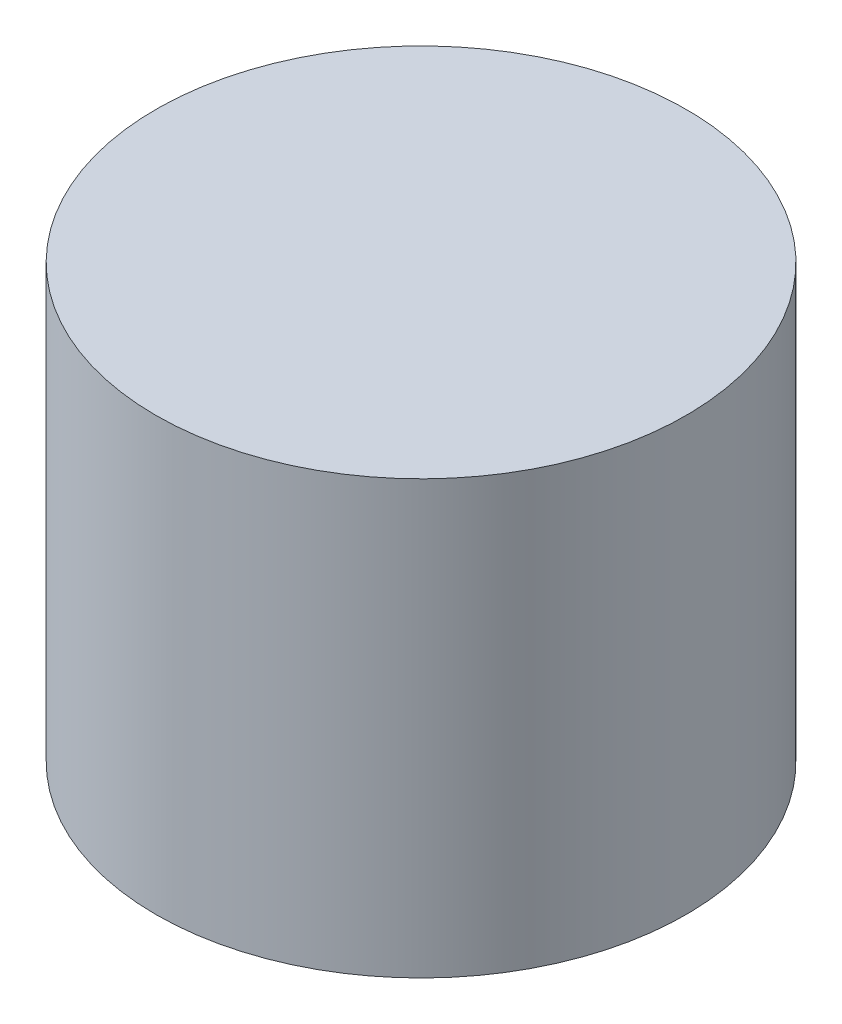
ISO-10303-21;
HEADER;
FILE_DESCRIPTION(('STEP AP214'),'2;1');
FILE_NAME('part.step','',(''),(''),'','','');
FILE_SCHEMA(('AUTOMOTIVE_DESIGN { 1 0 10303 214 1 1 1 1 }'));
ENDSEC;
DATA;
#1=APPLICATION_CONTEXT('core data for automotive mechanical design processes');
#2=APPLICATION_PROTOCOL_DEFINITION('international standard','automotive_design',2000,#1);
#3=PRODUCT_CONTEXT('',#1,'mechanical');
#4=PRODUCT('Part','Part','',(#3));
#5=PRODUCT_RELATED_PRODUCT_CATEGORY('part','',(#4));
#6=PRODUCT_DEFINITION_FORMATION('','',#4);
#7=PRODUCT_DEFINITION_CONTEXT('part definition',#1,'design');
#8=PRODUCT_DEFINITION('design','',#6,#7);
#9=PRODUCT_DEFINITION_SHAPE('','',#8);
#10=(LENGTH_UNIT() NAMED_UNIT(*) SI_UNIT(.MILLI.,.METRE.));
#11=(NAMED_UNIT(*) PLANE_ANGLE_UNIT() SI_UNIT($,.RADIAN.));
#12=(NAMED_UNIT(*) SI_UNIT($,.STERADIAN.) SOLID_ANGLE_UNIT());
#13=UNCERTAINTY_MEASURE_WITH_UNIT(LENGTH_MEASURE(1.E-05),#10,'distance_accuracy_value','');
#14=(GEOMETRIC_REPRESENTATION_CONTEXT(3) GLOBAL_UNCERTAINTY_ASSIGNED_CONTEXT((#13)) GLOBAL_UNIT_ASSIGNED_CONTEXT((#10,
#11,#12)) REPRESENTATION_CONTEXT('',''));
#15=CARTESIAN_POINT('',(0.,0.,0.));
#16=DIRECTION('',(0.,0.,1.));
#17=DIRECTION('',(1.,0.,0.));
#18=AXIS2_PLACEMENT_3D('',#15,#16,#17);
#19=CARTESIAN_POINT('',(0.,61.15,0.));
#20=DIRECTION('',(0.,-1.,0.));
#21=DIRECTION('',(0.,0.,-1.));
#22=AXIS2_PLACEMENT_3D('',#19,#20,#21);
#23=CYLINDRICAL_SURFACE('',#22,37.5);
#24=CARTESIAN_POINT('',(0.,61.15,0.));
#25=DIRECTION('',(0.,1.,0.));
#26=DIRECTION('',(0.,0.,1.));
#27=AXIS2_PLACEMENT_3D('',#24,#25,#26);
#28=CIRCLE('',#27,37.5);
#29=CARTESIAN_POINT('',(0.,61.15,37.5));
#30=VERTEX_POINT('',#29);
#31=EDGE_CURVE('E10',#30,#30,#28,.T.);
#32=ORIENTED_EDGE('',*,*,#31,.F.);
#33=EDGE_LOOP('',(#32));
#34=FACE_BOUND('',#33,.T.);
#35=CARTESIAN_POINT('',(0.,0.,0.));
#36=DIRECTION('',(0.,1.,0.));
#37=DIRECTION('',(0.,0.,1.));
#38=AXIS2_PLACEMENT_3D('',#35,#36,#37);
#39=CIRCLE('',#38,37.5);
#40=CARTESIAN_POINT('',(0.,0.,37.5));
#41=VERTEX_POINT('',#40);
#42=EDGE_CURVE('E47',#41,#41,#39,.T.);
#43=ORIENTED_EDGE('',*,*,#42,.T.);
#44=EDGE_LOOP('',(#43));
#45=FACE_BOUND('',#44,.T.);
#46=ADVANCED_FACE('F44',(#34,#45),#23,.T.);
#47=CARTESIAN_POINT('',(0.,61.15,0.));
#48=DIRECTION('',(0.,1.,0.));
#49=DIRECTION('',(0.,0.,1.));
#50=AXIS2_PLACEMENT_3D('',#47,#48,#49);
#51=PLANE('',#50);
#52=ORIENTED_EDGE('',*,*,#31,.T.);
#53=EDGE_LOOP('',(#52));
#54=FACE_BOUND('',#53,.T.);
#55=ADVANCED_FACE('F63',(#54),#51,.T.);
#56=CARTESIAN_POINT('',(0.,0.,0.));
#57=DIRECTION('',(0.,1.,0.));
#58=DIRECTION('',(0.,0.,1.));
#59=AXIS2_PLACEMENT_3D('',#56,#57,#58);
#60=PLANE('',#59);
#61=ORIENTED_EDGE('',*,*,#42,.F.);
#62=EDGE_LOOP('',(#61));
#63=FACE_BOUND('',#62,.T.);
#64=ADVANCED_FACE('F61',(#63),#60,.F.);
#65=CLOSED_SHELL('',(#46,#55,#64));
#66=MANIFOLD_SOLID_BREP('B2',#65);
#67=ADVANCED_BREP_SHAPE_REPRESENTATION('',(#18,#66),#14);
#68=SHAPE_DEFINITION_REPRESENTATION(#9,#67);
ENDSEC;
END-ISO-10303-21;
